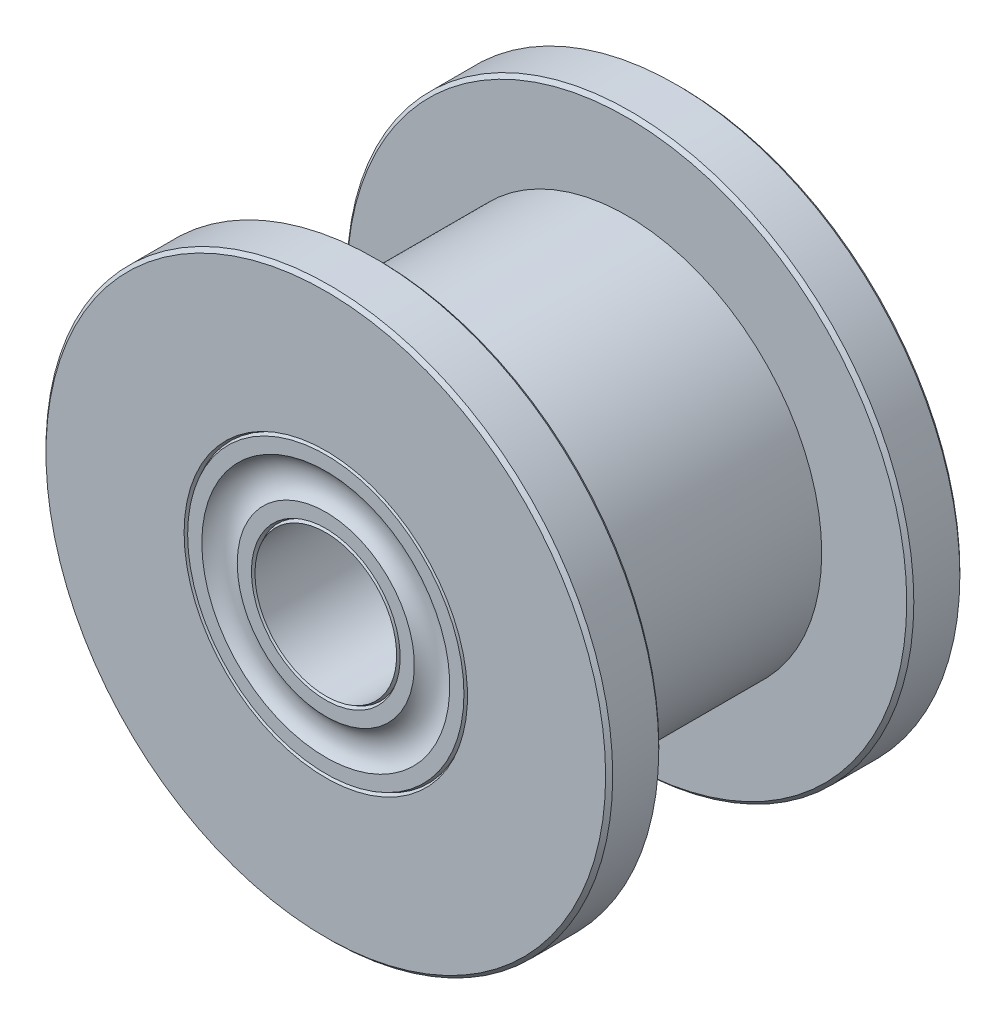
ISO-10303-21;
HEADER;
FILE_DESCRIPTION(('STEP AP214'),'2;1');
FILE_NAME('part.step','',(''),(''),'','','');
FILE_SCHEMA(('AUTOMOTIVE_DESIGN { 1 0 10303 214 1 1 1 1 }'));
ENDSEC;
DATA;
#1=APPLICATION_CONTEXT('core data for automotive mechanical design processes');
#2=APPLICATION_PROTOCOL_DEFINITION('international standard','automotive_design',2000,#1);
#3=PRODUCT_CONTEXT('',#1,'mechanical');
#4=PRODUCT('Part','Part','',(#3));
#5=PRODUCT_RELATED_PRODUCT_CATEGORY('part','',(#4));
#6=PRODUCT_DEFINITION_FORMATION('','',#4);
#7=PRODUCT_DEFINITION_CONTEXT('part definition',#1,'design');
#8=PRODUCT_DEFINITION('design','',#6,#7);
#9=PRODUCT_DEFINITION_SHAPE('','',#8);
#10=(LENGTH_UNIT() NAMED_UNIT(*) SI_UNIT(.MILLI.,.METRE.));
#11=(NAMED_UNIT(*) PLANE_ANGLE_UNIT() SI_UNIT($,.RADIAN.));
#12=(NAMED_UNIT(*) SI_UNIT($,.STERADIAN.) SOLID_ANGLE_UNIT());
#13=UNCERTAINTY_MEASURE_WITH_UNIT(LENGTH_MEASURE(1.E-05),#10,'distance_accuracy_value','');
#14=(GEOMETRIC_REPRESENTATION_CONTEXT(3) GLOBAL_UNCERTAINTY_ASSIGNED_CONTEXT((#13)) GLOBAL_UNIT_ASSIGNED_CONTEXT((#10,
#11,#12)) REPRESENTATION_CONTEXT('',''));
#15=CARTESIAN_POINT('',(0.,0.,0.));
#16=DIRECTION('',(0.,0.,1.));
#17=DIRECTION('',(1.,0.,0.));
#18=AXIS2_PLACEMENT_3D('',#15,#16,#17);
#19=CARTESIAN_POINT('',(0.,0.,10.));
#20=DIRECTION('',(0.,0.,1.));
#21=DIRECTION('',(1.,0.,0.));
#22=AXIS2_PLACEMENT_3D('',#19,#20,#21);
#23=PLANE('',#22);
#24=CARTESIAN_POINT('',(0.,0.,10.));
#25=DIRECTION('',(0.,0.,-1.));
#26=DIRECTION('',(-1.,0.,0.));
#27=AXIS2_PLACEMENT_3D('',#24,#25,#26);
#28=CIRCLE('',#27,4.);
#29=CARTESIAN_POINT('',(-4.,0.,10.));
#30=VERTEX_POINT('',#29);
#31=EDGE_CURVE('E99',#30,#30,#28,.T.);
#32=ORIENTED_EDGE('',*,*,#31,.T.);
#33=EDGE_LOOP('',(#32));
#34=FACE_BOUND('',#33,.T.);
#35=CARTESIAN_POINT('',(0.,0.,10.));
#36=DIRECTION('',(0.,0.,1.));
#37=DIRECTION('',(1.,0.,0.));
#38=AXIS2_PLACEMENT_3D('',#35,#36,#37);
#39=CIRCLE('',#38,7.9);
#40=CARTESIAN_POINT('',(7.9,0.,10.));
#41=VERTEX_POINT('',#40);
#42=EDGE_CURVE('E10',#41,#41,#39,.T.);
#43=ORIENTED_EDGE('',*,*,#42,.T.);
#44=EDGE_LOOP('',(#43));
#45=FACE_BOUND('',#44,.T.);
#46=ADVANCED_FACE('F34',(#34,#45),#23,.T.);
#47=CARTESIAN_POINT('',(0.,0.,0.));
#48=DIRECTION('',(0.,0.,1.));
#49=DIRECTION('',(1.,0.,0.));
#50=AXIS2_PLACEMENT_3D('',#47,#48,#49);
#51=PLANE('',#50);
#52=CARTESIAN_POINT('',(0.,0.,0.));
#53=DIRECTION('',(0.,0.,-1.));
#54=DIRECTION('',(-1.,0.,0.));
#55=AXIS2_PLACEMENT_3D('',#52,#53,#54);
#56=CIRCLE('',#55,4.);
#57=CARTESIAN_POINT('',(-4.,0.,0.));
#58=VERTEX_POINT('',#57);
#59=EDGE_CURVE('E70',#58,#58,#56,.T.);
#60=ORIENTED_EDGE('',*,*,#59,.F.);
#61=EDGE_LOOP('',(#60));
#62=FACE_BOUND('',#61,.T.);
#63=CARTESIAN_POINT('',(0.,0.,0.));
#64=DIRECTION('',(0.,0.,1.));
#65=DIRECTION('',(1.,0.,0.));
#66=AXIS2_PLACEMENT_3D('',#63,#64,#65);
#67=CIRCLE('',#66,7.9);
#68=CARTESIAN_POINT('',(7.9,0.,0.));
#69=VERTEX_POINT('',#68);
#70=EDGE_CURVE('E57',#69,#69,#67,.F.);
#71=ORIENTED_EDGE('',*,*,#70,.T.);
#72=EDGE_LOOP('',(#71));
#73=FACE_BOUND('',#72,.T.);
#74=ADVANCED_FACE('F155',(#62,#73),#51,.F.);
#75=CARTESIAN_POINT('',(0.,0.,10.));
#76=DIRECTION('',(0.,0.,-1.));
#77=DIRECTION('',(-1.,0.,0.));
#78=AXIS2_PLACEMENT_3D('',#75,#76,#77);
#79=CYLINDRICAL_SURFACE('',#78,5.5);
#80=CARTESIAN_POINT('',(0.,0.,1.5));
#81=DIRECTION('',(0.,0.,1.));
#82=DIRECTION('',(1.,0.,0.));
#83=AXIS2_PLACEMENT_3D('',#80,#81,#82);
#84=CIRCLE('',#83,5.5);
#85=CARTESIAN_POINT('',(5.5,0.,1.5));
#86=VERTEX_POINT('',#85);
#87=EDGE_CURVE('E67',#86,#86,#84,.T.);
#88=ORIENTED_EDGE('',*,*,#87,.T.);
#89=EDGE_LOOP('',(#88));
#90=FACE_BOUND('',#89,.T.);
#91=CARTESIAN_POINT('',(0.,0.,8.5));
#92=DIRECTION('',(0.,0.,1.));
#93=DIRECTION('',(1.,0.,0.));
#94=AXIS2_PLACEMENT_3D('',#91,#92,#93);
#95=CIRCLE('',#94,5.5);
#96=CARTESIAN_POINT('',(5.5,0.,8.5));
#97=VERTEX_POINT('',#96);
#98=EDGE_CURVE('E66',#97,#97,#95,.T.);
#99=ORIENTED_EDGE('',*,*,#98,.F.);
#100=EDGE_LOOP('',(#99));
#101=FACE_BOUND('',#100,.T.);
#102=ADVANCED_FACE('F134',(#90,#101),#79,.T.);
#103=CARTESIAN_POINT('',(0.,0.,10.));
#104=DIRECTION('',(0.,0.,-1.));
#105=DIRECTION('',(-1.,0.,0.));
#106=AXIS2_PLACEMENT_3D('',#103,#104,#105);
#107=CYLINDRICAL_SURFACE('',#106,2.);
#108=CARTESIAN_POINT('',(0.,0.,10.));
#109=DIRECTION('',(0.,0.,-1.));
#110=DIRECTION('',(-1.,0.,0.));
#111=AXIS2_PLACEMENT_3D('',#108,#109,#110);
#112=CIRCLE('',#111,2.);
#113=CARTESIAN_POINT('',(-2.,0.,10.));
#114=VERTEX_POINT('',#113);
#115=EDGE_CURVE('E96',#114,#114,#112,.T.);
#116=ORIENTED_EDGE('',*,*,#115,.F.);
#117=EDGE_LOOP('',(#116));
#118=FACE_BOUND('',#117,.T.);
#119=CARTESIAN_POINT('',(0.,0.,0.));
#120=DIRECTION('',(0.,0.,-1.));
#121=DIRECTION('',(-1.,0.,0.));
#122=AXIS2_PLACEMENT_3D('',#119,#120,#121);
#123=CIRCLE('',#122,2.);
#124=CARTESIAN_POINT('',(-2.,0.,0.));
#125=VERTEX_POINT('',#124);
#126=EDGE_CURVE('E93',#125,#125,#123,.T.);
#127=ORIENTED_EDGE('',*,*,#126,.T.);
#128=EDGE_LOOP('',(#127));
#129=FACE_BOUND('',#128,.T.);
#130=ADVANCED_FACE('F130',(#118,#129),#107,.F.);
#131=CARTESIAN_POINT('',(0.,0.,1.5));
#132=DIRECTION('',(0.,0.,1.));
#133=DIRECTION('',(1.,0.,0.));
#134=AXIS2_PLACEMENT_3D('',#131,#132,#133);
#135=PLANE('',#134);
#136=CARTESIAN_POINT('',(0.,0.,1.5));
#137=DIRECTION('',(0.,0.,1.));
#138=DIRECTION('',(1.,0.,0.));
#139=AXIS2_PLACEMENT_3D('',#136,#137,#138);
#140=CIRCLE('',#139,7.9);
#141=CARTESIAN_POINT('',(7.9,0.,1.5));
#142=VERTEX_POINT('',#141);
#143=EDGE_CURVE('E54',#142,#142,#140,.T.);
#144=ORIENTED_EDGE('',*,*,#143,.T.);
#145=EDGE_LOOP('',(#144));
#146=FACE_BOUND('',#145,.T.);
#147=ORIENTED_EDGE('',*,*,#87,.F.);
#148=EDGE_LOOP('',(#147));
#149=FACE_BOUND('',#148,.T.);
#150=ADVANCED_FACE('F133',(#146,#149),#135,.T.);
#151=CARTESIAN_POINT('',(0.,0.,1.5));
#152=DIRECTION('',(0.,0.,-1.));
#153=DIRECTION('',(-1.,0.,0.));
#154=AXIS2_PLACEMENT_3D('',#151,#152,#153);
#155=CYLINDRICAL_SURFACE('',#154,8.);
#156=CARTESIAN_POINT('',(0.,0.,0.0999999999999959));
#157=DIRECTION('',(0.,0.,1.));
#158=DIRECTION('',(1.,0.,0.));
#159=AXIS2_PLACEMENT_3D('',#156,#157,#158);
#160=CIRCLE('',#159,8.);
#161=CARTESIAN_POINT('',(8.,0.,0.0999999999999959));
#162=VERTEX_POINT('',#161);
#163=EDGE_CURVE('E60',#162,#162,#160,.T.);
#164=ORIENTED_EDGE('',*,*,#163,.T.);
#165=EDGE_LOOP('',(#164));
#166=FACE_BOUND('',#165,.T.);
#167=CARTESIAN_POINT('',(0.,0.,1.4));
#168=DIRECTION('',(0.,0.,1.));
#169=DIRECTION('',(1.,0.,0.));
#170=AXIS2_PLACEMENT_3D('',#167,#168,#169);
#171=CIRCLE('',#170,8.);
#172=CARTESIAN_POINT('',(8.,0.,1.4));
#173=VERTEX_POINT('',#172);
#174=EDGE_CURVE('E63',#173,#173,#171,.F.);
#175=ORIENTED_EDGE('',*,*,#174,.T.);
#176=EDGE_LOOP('',(#175));
#177=FACE_BOUND('',#176,.T.);
#178=ADVANCED_FACE('F213',(#166,#177),#155,.T.);
#179=CARTESIAN_POINT('',(0.,0.,8.5));
#180=DIRECTION('',(0.,0.,1.));
#181=DIRECTION('',(1.,0.,0.));
#182=AXIS2_PLACEMENT_3D('',#179,#180,#181);
#183=PLANE('',#182);
#184=CARTESIAN_POINT('',(0.,0.,8.5));
#185=DIRECTION('',(0.,0.,1.));
#186=DIRECTION('',(1.,0.,0.));
#187=AXIS2_PLACEMENT_3D('',#184,#185,#186);
#188=CIRCLE('',#187,7.9);
#189=CARTESIAN_POINT('',(7.9,0.,8.5));
#190=VERTEX_POINT('',#189);
#191=EDGE_CURVE('E41',#190,#190,#188,.F.);
#192=ORIENTED_EDGE('',*,*,#191,.T.);
#193=EDGE_LOOP('',(#192));
#194=FACE_BOUND('',#193,.T.);
#195=ORIENTED_EDGE('',*,*,#98,.T.);
#196=EDGE_LOOP('',(#195));
#197=FACE_BOUND('',#196,.T.);
#198=ADVANCED_FACE('F209',(#194,#197),#183,.F.);
#199=CARTESIAN_POINT('',(0.,0.,10.));
#200=DIRECTION('',(0.,0.,-1.));
#201=DIRECTION('',(-1.,0.,0.));
#202=AXIS2_PLACEMENT_3D('',#199,#200,#201);
#203=CYLINDRICAL_SURFACE('',#202,8.);
#204=CARTESIAN_POINT('',(0.,0.,8.6));
#205=DIRECTION('',(0.,0.,1.));
#206=DIRECTION('',(1.,0.,0.));
#207=AXIS2_PLACEMENT_3D('',#204,#205,#206);
#208=CIRCLE('',#207,8.);
#209=CARTESIAN_POINT('',(8.,0.,8.6));
#210=VERTEX_POINT('',#209);
#211=EDGE_CURVE('E45',#210,#210,#208,.T.);
#212=ORIENTED_EDGE('',*,*,#211,.T.);
#213=EDGE_LOOP('',(#212));
#214=FACE_BOUND('',#213,.T.);
#215=CARTESIAN_POINT('',(0.,0.,9.90000000000001));
#216=DIRECTION('',(0.,0.,1.));
#217=DIRECTION('',(1.,0.,0.));
#218=AXIS2_PLACEMENT_3D('',#215,#216,#217);
#219=CIRCLE('',#218,8.);
#220=CARTESIAN_POINT('',(8.,0.,9.90000000000001));
#221=VERTEX_POINT('',#220);
#222=EDGE_CURVE('E49',#221,#221,#219,.F.);
#223=ORIENTED_EDGE('',*,*,#222,.T.);
#224=EDGE_LOOP('',(#223));
#225=FACE_BOUND('',#224,.T.);
#226=ADVANCED_FACE('F212',(#214,#225),#203,.T.);
#227=CARTESIAN_POINT('',(0.,0.,0.0999999999999959));
#228=DIRECTION('',(0.,0.,1.));
#229=DIRECTION('',(1.,0.,0.));
#230=AXIS2_PLACEMENT_3D('',#227,#228,#229);
#231=CONICAL_SURFACE('',#230,8.,0.785398163397457);
#232=ORIENTED_EDGE('',*,*,#70,.F.);
#233=EDGE_LOOP('',(#232));
#234=FACE_BOUND('',#233,.T.);
#235=ORIENTED_EDGE('',*,*,#163,.F.);
#236=EDGE_LOOP('',(#235));
#237=FACE_BOUND('',#236,.T.);
#238=ADVANCED_FACE('F216',(#234,#237),#231,.T.);
#239=CARTESIAN_POINT('',(0.,0.,1.5));
#240=DIRECTION('',(0.,0.,-1.));
#241=DIRECTION('',(-1.,0.,0.));
#242=AXIS2_PLACEMENT_3D('',#239,#240,#241);
#243=CONICAL_SURFACE('',#242,7.9,0.785398163397448);
#244=ORIENTED_EDGE('',*,*,#174,.F.);
#245=EDGE_LOOP('',(#244));
#246=FACE_BOUND('',#245,.T.);
#247=ORIENTED_EDGE('',*,*,#143,.F.);
#248=EDGE_LOOP('',(#247));
#249=FACE_BOUND('',#248,.T.);
#250=ADVANCED_FACE('F229',(#246,#249),#243,.T.);
#251=CARTESIAN_POINT('',(0.,0.,8.6));
#252=DIRECTION('',(0.,0.,1.));
#253=DIRECTION('',(1.,0.,0.));
#254=AXIS2_PLACEMENT_3D('',#251,#252,#253);
#255=CONICAL_SURFACE('',#254,8.,0.78539816339744);
#256=ORIENTED_EDGE('',*,*,#191,.F.);
#257=EDGE_LOOP('',(#256));
#258=FACE_BOUND('',#257,.T.);
#259=ORIENTED_EDGE('',*,*,#211,.F.);
#260=EDGE_LOOP('',(#259));
#261=FACE_BOUND('',#260,.T.);
#262=ADVANCED_FACE('F232',(#258,#261),#255,.T.);
#263=CARTESIAN_POINT('',(0.,0.,10.));
#264=DIRECTION('',(0.,0.,-1.));
#265=DIRECTION('',(-1.,0.,0.));
#266=AXIS2_PLACEMENT_3D('',#263,#264,#265);
#267=CONICAL_SURFACE('',#266,7.9,0.785398163397474);
#268=ORIENTED_EDGE('',*,*,#222,.F.);
#269=EDGE_LOOP('',(#268));
#270=FACE_BOUND('',#269,.T.);
#271=ORIENTED_EDGE('',*,*,#42,.F.);
#272=EDGE_LOOP('',(#271));
#273=FACE_BOUND('',#272,.T.);
#274=ADVANCED_FACE('F36',(#270,#273),#267,.T.);
#275=CARTESIAN_POINT('',(0.,0.,0.0999999999999959));
#276=DIRECTION('',(0.,0.,1.));
#277=DIRECTION('',(1.,0.,0.));
#278=AXIS2_PLACEMENT_3D('',#275,#276,#277);
#279=CONICAL_SURFACE('',#278,2.05,0.46364760900082);
#280=ORIENTED_EDGE('',*,*,#126,.F.);
#281=EDGE_LOOP('',(#280));
#282=FACE_BOUND('',#281,.T.);
#283=CARTESIAN_POINT('',(0.,0.,0.0999999999999959));
#284=DIRECTION('',(0.,0.,-1.));
#285=DIRECTION('',(-1.,0.,0.));
#286=AXIS2_PLACEMENT_3D('',#283,#284,#285);
#287=CIRCLE('',#286,2.05);
#288=CARTESIAN_POINT('',(-2.05,0.,0.0999999999999959));
#289=VERTEX_POINT('',#288);
#290=EDGE_CURVE('E90',#289,#289,#287,.T.);
#291=ORIENTED_EDGE('',*,*,#290,.T.);
#292=EDGE_LOOP('',(#291));
#293=FACE_BOUND('',#292,.T.);
#294=ADVANCED_FACE('F138',(#282,#293),#279,.T.);
#295=CARTESIAN_POINT('',(0.,0.,0.));
#296=DIRECTION('',(0.,0.,-1.));
#297=DIRECTION('',(-1.,0.,0.));
#298=AXIS2_PLACEMENT_3D('',#295,#296,#297);
#299=CONICAL_SURFACE('',#298,2.1,0.463647609000823);
#300=ORIENTED_EDGE('',*,*,#290,.F.);
#301=EDGE_LOOP('',(#300));
#302=FACE_BOUND('',#301,.T.);
#303=CARTESIAN_POINT('',(0.,0.,0.));
#304=DIRECTION('',(0.,0.,-1.));
#305=DIRECTION('',(-1.,0.,0.));
#306=AXIS2_PLACEMENT_3D('',#303,#304,#305);
#307=CIRCLE('',#306,2.1);
#308=CARTESIAN_POINT('',(-2.1,0.,0.));
#309=VERTEX_POINT('',#308);
#310=EDGE_CURVE('E87',#309,#309,#307,.T.);
#311=ORIENTED_EDGE('',*,*,#310,.T.);
#312=EDGE_LOOP('',(#311));
#313=FACE_BOUND('',#312,.T.);
#314=ADVANCED_FACE('F141',(#302,#313),#299,.F.);
#315=CARTESIAN_POINT('',(0.,0.,0.));
#316=DIRECTION('',(0.,0.,-1.));
#317=DIRECTION('',(-1.,0.,0.));
#318=AXIS2_PLACEMENT_3D('',#315,#316,#317);
#319=CIRCLE('',#318,2.5);
#320=CARTESIAN_POINT('',(-2.5,0.,0.));
#321=VERTEX_POINT('',#320);
#322=EDGE_CURVE('E84',#321,#321,#319,.T.);
#323=ORIENTED_EDGE('',*,*,#322,.T.);
#324=EDGE_LOOP('',(#323));
#325=FACE_BOUND('',#324,.T.);
#326=ORIENTED_EDGE('',*,*,#310,.F.);
#327=EDGE_LOOP('',(#326));
#328=FACE_BOUND('',#327,.T.);
#329=ADVANCED_FACE('F147',(#325,#328),#51,.F.);
#330=CARTESIAN_POINT('',(0.,0.,-0.489897948556636));
#331=DIRECTION('',(0.,0.,-1.));
#332=DIRECTION('',(-1.,0.,0.));
#333=AXIS2_PLACEMENT_3D('',#330,#331,#332);
#334=TOROIDAL_SURFACE('',#333,3.,0.7);
#335=ORIENTED_EDGE('',*,*,#322,.F.);
#336=EDGE_LOOP('',(#335));
#337=FACE_BOUND('',#336,.T.);
#338=CARTESIAN_POINT('',(0.,0.,0.));
#339=DIRECTION('',(0.,0.,-1.));
#340=DIRECTION('',(-1.,0.,0.));
#341=AXIS2_PLACEMENT_3D('',#338,#339,#340);
#342=CIRCLE('',#341,3.5);
#343=CARTESIAN_POINT('',(-3.5,0.,0.));
#344=VERTEX_POINT('',#343);
#345=EDGE_CURVE('E81',#344,#344,#342,.T.);
#346=ORIENTED_EDGE('',*,*,#345,.T.);
#347=EDGE_LOOP('',(#346));
#348=FACE_BOUND('',#347,.T.);
#349=ADVANCED_FACE('F152',(#337,#348),#334,.F.);
#350=CARTESIAN_POINT('',(0.,0.,0.));
#351=DIRECTION('',(0.,0.,-1.));
#352=DIRECTION('',(-1.,0.,0.));
#353=AXIS2_PLACEMENT_3D('',#350,#351,#352);
#354=CIRCLE('',#353,3.9);
#355=CARTESIAN_POINT('',(-3.9,0.,0.));
#356=VERTEX_POINT('',#355);
#357=EDGE_CURVE('E78',#356,#356,#354,.T.);
#358=ORIENTED_EDGE('',*,*,#357,.T.);
#359=EDGE_LOOP('',(#358));
#360=FACE_BOUND('',#359,.T.);
#361=ORIENTED_EDGE('',*,*,#345,.F.);
#362=EDGE_LOOP('',(#361));
#363=FACE_BOUND('',#362,.T.);
#364=ADVANCED_FACE('F156',(#360,#363),#51,.F.);
#365=CARTESIAN_POINT('',(0.,0.,0.));
#366=DIRECTION('',(0.,0.,-1.));
#367=DIRECTION('',(-1.,0.,0.));
#368=AXIS2_PLACEMENT_3D('',#365,#366,#367);
#369=CONICAL_SURFACE('',#368,4.,0.46364760900082);
#370=CARTESIAN_POINT('',(0.,0.,0.0999999999999959));
#371=DIRECTION('',(0.,0.,-1.));
#372=DIRECTION('',(-1.,0.,0.));
#373=AXIS2_PLACEMENT_3D('',#370,#371,#372);
#374=CIRCLE('',#373,3.95);
#375=CARTESIAN_POINT('',(-3.95,0.,0.0999999999999959));
#376=VERTEX_POINT('',#375);
#377=EDGE_CURVE('E75',#376,#376,#374,.T.);
#378=ORIENTED_EDGE('',*,*,#377,.F.);
#379=EDGE_LOOP('',(#378));
#380=FACE_BOUND('',#379,.T.);
#381=ORIENTED_EDGE('',*,*,#59,.T.);
#382=EDGE_LOOP('',(#381));
#383=FACE_BOUND('',#382,.T.);
#384=ADVANCED_FACE('F167',(#380,#383),#369,.F.);
#385=CARTESIAN_POINT('',(0.,0.,0.0999999999999959));
#386=DIRECTION('',(0.,0.,1.));
#387=DIRECTION('',(1.,0.,0.));
#388=AXIS2_PLACEMENT_3D('',#385,#386,#387);
#389=CONICAL_SURFACE('',#388,3.95,0.463647609000823);
#390=ORIENTED_EDGE('',*,*,#357,.F.);
#391=EDGE_LOOP('',(#390));
#392=FACE_BOUND('',#391,.T.);
#393=ORIENTED_EDGE('',*,*,#377,.T.);
#394=EDGE_LOOP('',(#393));
#395=FACE_BOUND('',#394,.T.);
#396=ADVANCED_FACE('F126',(#392,#395),#389,.T.);
#397=CARTESIAN_POINT('',(0.,0.,10.));
#398=DIRECTION('',(0.,0.,-1.));
#399=DIRECTION('',(-1.,0.,0.));
#400=AXIS2_PLACEMENT_3D('',#397,#398,#399);
#401=CONICAL_SURFACE('',#400,2.,0.46364760900082);
#402=CARTESIAN_POINT('',(0.,0.,9.9));
#403=DIRECTION('',(0.,0.,-1.));
#404=DIRECTION('',(-1.,0.,0.));
#405=AXIS2_PLACEMENT_3D('',#402,#403,#404);
#406=CIRCLE('',#405,2.05);
#407=CARTESIAN_POINT('',(-2.05,0.,9.9));
#408=VERTEX_POINT('',#407);
#409=EDGE_CURVE('E117',#408,#408,#406,.T.);
#410=ORIENTED_EDGE('',*,*,#409,.F.);
#411=EDGE_LOOP('',(#410));
#412=FACE_BOUND('',#411,.T.);
#413=ORIENTED_EDGE('',*,*,#115,.T.);
#414=EDGE_LOOP('',(#413));
#415=FACE_BOUND('',#414,.T.);
#416=ADVANCED_FACE('F123',(#412,#415),#401,.T.);
#417=CARTESIAN_POINT('',(0.,0.,9.9));
#418=DIRECTION('',(0.,0.,1.));
#419=DIRECTION('',(1.,0.,0.));
#420=AXIS2_PLACEMENT_3D('',#417,#418,#419);
#421=CONICAL_SURFACE('',#420,2.05,0.463647609000823);
#422=CARTESIAN_POINT('',(0.,0.,10.));
#423=DIRECTION('',(0.,0.,-1.));
#424=DIRECTION('',(-1.,0.,0.));
#425=AXIS2_PLACEMENT_3D('',#422,#423,#424);
#426=CIRCLE('',#425,2.1);
#427=CARTESIAN_POINT('',(-2.1,0.,10.));
#428=VERTEX_POINT('',#427);
#429=EDGE_CURVE('E114',#428,#428,#426,.T.);
#430=ORIENTED_EDGE('',*,*,#429,.F.);
#431=EDGE_LOOP('',(#430));
#432=FACE_BOUND('',#431,.T.);
#433=ORIENTED_EDGE('',*,*,#409,.T.);
#434=EDGE_LOOP('',(#433));
#435=FACE_BOUND('',#434,.T.);
#436=ADVANCED_FACE('F121',(#432,#435),#421,.F.);
#437=CARTESIAN_POINT('',(0.,0.,10.));
#438=DIRECTION('',(0.,0.,-1.));
#439=DIRECTION('',(-1.,0.,0.));
#440=AXIS2_PLACEMENT_3D('',#437,#438,#439);
#441=CIRCLE('',#440,2.5);
#442=CARTESIAN_POINT('',(-2.5,0.,10.));
#443=VERTEX_POINT('',#442);
#444=EDGE_CURVE('E111',#443,#443,#441,.T.);
#445=ORIENTED_EDGE('',*,*,#444,.F.);
#446=EDGE_LOOP('',(#445));
#447=FACE_BOUND('',#446,.T.);
#448=ORIENTED_EDGE('',*,*,#429,.T.);
#449=EDGE_LOOP('',(#448));
#450=FACE_BOUND('',#449,.T.);
#451=ADVANCED_FACE('F172',(#447,#450),#23,.T.);
#452=CARTESIAN_POINT('',(0.,0.,10.4898979485566));
#453=DIRECTION('',(0.,0.,-1.));
#454=DIRECTION('',(-1.,0.,0.));
#455=AXIS2_PLACEMENT_3D('',#452,#453,#454);
#456=TOROIDAL_SURFACE('',#455,3.,0.7);
#457=CARTESIAN_POINT('',(0.,0.,10.));
#458=DIRECTION('',(0.,0.,-1.));
#459=DIRECTION('',(-1.,0.,0.));
#460=AXIS2_PLACEMENT_3D('',#457,#458,#459);
#461=CIRCLE('',#460,3.5);
#462=CARTESIAN_POINT('',(-3.5,0.,10.));
#463=VERTEX_POINT('',#462);
#464=EDGE_CURVE('E108',#463,#463,#461,.T.);
#465=ORIENTED_EDGE('',*,*,#464,.F.);
#466=EDGE_LOOP('',(#465));
#467=FACE_BOUND('',#466,.T.);
#468=ORIENTED_EDGE('',*,*,#444,.T.);
#469=EDGE_LOOP('',(#468));
#470=FACE_BOUND('',#469,.T.);
#471=ADVANCED_FACE('F177',(#467,#470),#456,.F.);
#472=CARTESIAN_POINT('',(0.,0.,10.));
#473=DIRECTION('',(0.,0.,-1.));
#474=DIRECTION('',(-1.,0.,0.));
#475=AXIS2_PLACEMENT_3D('',#472,#473,#474);
#476=CIRCLE('',#475,3.9);
#477=CARTESIAN_POINT('',(-3.9,0.,10.));
#478=VERTEX_POINT('',#477);
#479=EDGE_CURVE('E105',#478,#478,#476,.T.);
#480=ORIENTED_EDGE('',*,*,#479,.F.);
#481=EDGE_LOOP('',(#480));
#482=FACE_BOUND('',#481,.T.);
#483=ORIENTED_EDGE('',*,*,#464,.T.);
#484=EDGE_LOOP('',(#483));
#485=FACE_BOUND('',#484,.T.);
#486=ADVANCED_FACE('F171',(#482,#485),#23,.T.);
#487=CARTESIAN_POINT('',(0.,0.,9.9));
#488=DIRECTION('',(0.,0.,1.));
#489=DIRECTION('',(1.,0.,0.));
#490=AXIS2_PLACEMENT_3D('',#487,#488,#489);
#491=CONICAL_SURFACE('',#490,3.95,0.46364760900082);
#492=ORIENTED_EDGE('',*,*,#31,.F.);
#493=EDGE_LOOP('',(#492));
#494=FACE_BOUND('',#493,.T.);
#495=CARTESIAN_POINT('',(0.,0.,9.9));
#496=DIRECTION('',(0.,0.,-1.));
#497=DIRECTION('',(-1.,0.,0.));
#498=AXIS2_PLACEMENT_3D('',#495,#496,#497);
#499=CIRCLE('',#498,3.95);
#500=CARTESIAN_POINT('',(-3.95,0.,9.9));
#501=VERTEX_POINT('',#500);
#502=EDGE_CURVE('E102',#501,#501,#499,.T.);
#503=ORIENTED_EDGE('',*,*,#502,.T.);
#504=EDGE_LOOP('',(#503));
#505=FACE_BOUND('',#504,.T.);
#506=ADVANCED_FACE('F176',(#494,#505),#491,.F.);
#507=CARTESIAN_POINT('',(0.,0.,10.));
#508=DIRECTION('',(0.,0.,-1.));
#509=DIRECTION('',(-1.,0.,0.));
#510=AXIS2_PLACEMENT_3D('',#507,#508,#509);
#511=CONICAL_SURFACE('',#510,3.9,0.463647609000823);
#512=ORIENTED_EDGE('',*,*,#502,.F.);
#513=EDGE_LOOP('',(#512));
#514=FACE_BOUND('',#513,.T.);
#515=ORIENTED_EDGE('',*,*,#479,.T.);
#516=EDGE_LOOP('',(#515));
#517=FACE_BOUND('',#516,.T.);
#518=ADVANCED_FACE('F196',(#514,#517),#511,.T.);
#519=CLOSED_SHELL('',(#46,#74,#102,#130,#150,#178,#198,#226,#238,#250,#262,#274,#294,#314,#329,
#349,#364,#384,#396,#416,#436,#451,#471,#486,#506,#518));
#520=MANIFOLD_SOLID_BREP('B2',#519);
#521=ADVANCED_BREP_SHAPE_REPRESENTATION('',(#18,#520),#14);
#522=SHAPE_DEFINITION_REPRESENTATION(#9,#521);
ENDSEC;
END-ISO-10303-21;
